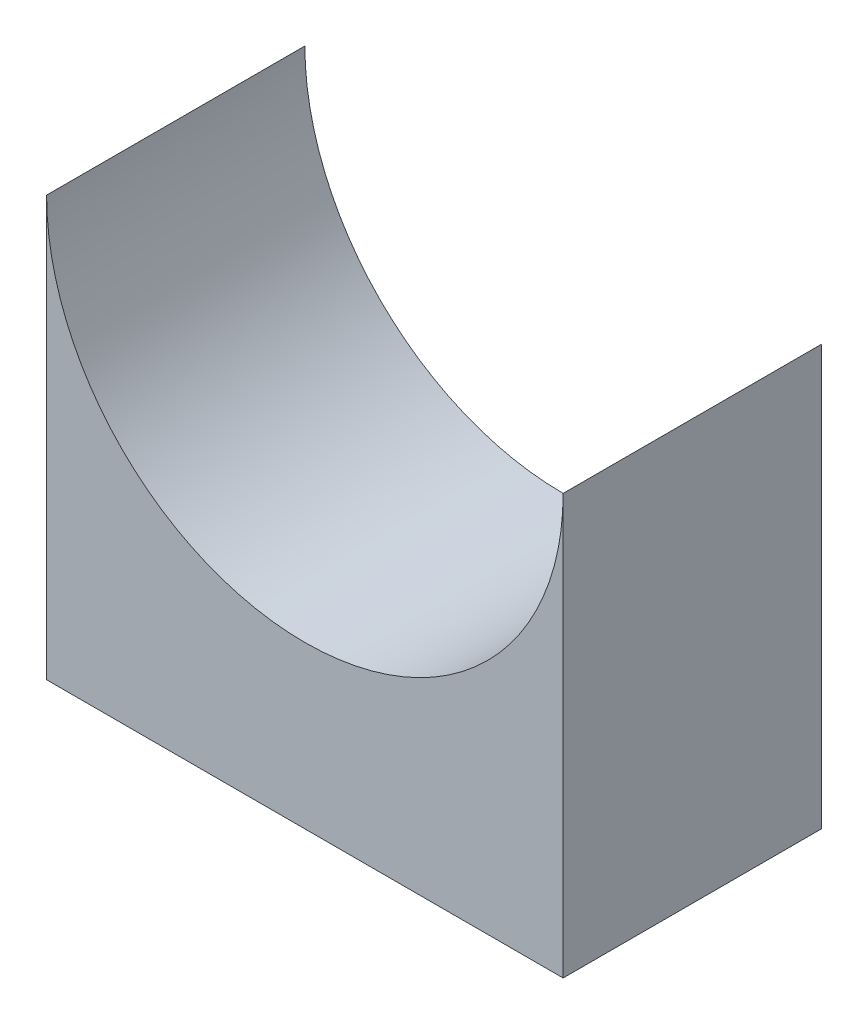
ISO-10303-21;
HEADER;
FILE_DESCRIPTION(('STEP AP214'),'2;1');
FILE_NAME('part.step','',(''),(''),'','','');
FILE_SCHEMA(('AUTOMOTIVE_DESIGN { 1 0 10303 214 1 1 1 1 }'));
ENDSEC;
DATA;
#1=APPLICATION_CONTEXT('core data for automotive mechanical design processes');
#2=APPLICATION_PROTOCOL_DEFINITION('international standard','automotive_design',2000,#1);
#3=PRODUCT_CONTEXT('',#1,'mechanical');
#4=PRODUCT('Part','Part','',(#3));
#5=PRODUCT_RELATED_PRODUCT_CATEGORY('part','',(#4));
#6=PRODUCT_DEFINITION_FORMATION('','',#4);
#7=PRODUCT_DEFINITION_CONTEXT('part definition',#1,'design');
#8=PRODUCT_DEFINITION('design','',#6,#7);
#9=PRODUCT_DEFINITION_SHAPE('','',#8);
#10=(LENGTH_UNIT() NAMED_UNIT(*) SI_UNIT(.MILLI.,.METRE.));
#11=(NAMED_UNIT(*) PLANE_ANGLE_UNIT() SI_UNIT($,.RADIAN.));
#12=(NAMED_UNIT(*) SI_UNIT($,.STERADIAN.) SOLID_ANGLE_UNIT());
#13=UNCERTAINTY_MEASURE_WITH_UNIT(LENGTH_MEASURE(1.E-05),#10,'distance_accuracy_value','');
#14=(GEOMETRIC_REPRESENTATION_CONTEXT(3) GLOBAL_UNCERTAINTY_ASSIGNED_CONTEXT((#13)) GLOBAL_UNIT_ASSIGNED_CONTEXT((#10,
#11,#12)) REPRESENTATION_CONTEXT('',''));
#15=CARTESIAN_POINT('',(0.,0.,0.));
#16=DIRECTION('',(0.,0.,1.));
#17=DIRECTION('',(1.,0.,0.));
#18=AXIS2_PLACEMENT_3D('',#15,#16,#17);
#19=CARTESIAN_POINT('',(0.,0.,20.));
#20=DIRECTION('',(1.,0.,0.));
#21=DIRECTION('',(0.,0.,-1.));
#22=AXIS2_PLACEMENT_3D('',#19,#20,#21);
#23=PLANE('',#22);
#24=DIRECTION('',(0.,-1.,0.));
#25=VECTOR('',#24,1.);
#26=CARTESIAN_POINT('',(0.,0.,0.));
#27=LINE('',#26,#25);
#28=CARTESIAN_POINT('',(0.,32.5000000000003,2.77555756156289E-13));
#29=VERTEX_POINT('',#28);
#30=CARTESIAN_POINT('',(0.,0.,0.));
#31=VERTEX_POINT('',#30);
#32=EDGE_CURVE('E95',#29,#31,#27,.T.);
#33=ORIENTED_EDGE('',*,*,#32,.T.);
#34=DIRECTION('',(0.,0.,-1.));
#35=VECTOR('',#34,1.);
#36=CARTESIAN_POINT('',(0.,0.,20.));
#37=LINE('',#36,#35);
#38=CARTESIAN_POINT('',(0.,0.,20.));
#39=VERTEX_POINT('',#38);
#40=EDGE_CURVE('E11',#39,#31,#37,.T.);
#41=ORIENTED_EDGE('',*,*,#40,.F.);
#42=DIRECTION('',(0.,-1.,0.));
#43=VECTOR('',#42,1.);
#44=CARTESIAN_POINT('',(0.,0.,20.));
#45=LINE('',#44,#43);
#46=CARTESIAN_POINT('',(0.,32.5000000000003,20.0000000000002));
#47=VERTEX_POINT('',#46);
#48=EDGE_CURVE('E83',#47,#39,#45,.T.);
#49=ORIENTED_EDGE('',*,*,#48,.F.);
#50=DIRECTION('',(0.,0.,-1.));
#51=VECTOR('',#50,1.);
#52=CARTESIAN_POINT('',(0.,32.5000000000003,20.0000000000002));
#53=LINE('',#52,#51);
#54=EDGE_CURVE('E91',#47,#29,#53,.T.);
#55=ORIENTED_EDGE('',*,*,#54,.T.);
#56=EDGE_LOOP('',(#33,#41,#49,#55));
#57=FACE_BOUND('',#56,.T.);
#58=ADVANCED_FACE('F32',(#57),#23,.F.);
#59=CARTESIAN_POINT('',(0.,0.,20.));
#60=DIRECTION('',(0.,1.,0.));
#61=DIRECTION('',(0.,0.,1.));
#62=AXIS2_PLACEMENT_3D('',#59,#60,#61);
#63=PLANE('',#62);
#64=DIRECTION('',(1.,0.,0.));
#65=VECTOR('',#64,1.);
#66=CARTESIAN_POINT('',(0.,0.,0.));
#67=LINE('',#66,#65);
#68=CARTESIAN_POINT('',(40.,0.,0.));
#69=VERTEX_POINT('',#68);
#70=EDGE_CURVE('E87',#31,#69,#67,.T.);
#71=ORIENTED_EDGE('',*,*,#70,.T.);
#72=DIRECTION('',(0.,0.,-1.));
#73=VECTOR('',#72,1.);
#74=CARTESIAN_POINT('',(40.,0.,20.));
#75=LINE('',#74,#73);
#76=CARTESIAN_POINT('',(40.,0.,20.));
#77=VERTEX_POINT('',#76);
#78=EDGE_CURVE('E40',#77,#69,#75,.T.);
#79=ORIENTED_EDGE('',*,*,#78,.F.);
#80=DIRECTION('',(1.,0.,0.));
#81=VECTOR('',#80,1.);
#82=CARTESIAN_POINT('',(0.,0.,20.));
#83=LINE('',#82,#81);
#84=EDGE_CURVE('E78',#39,#77,#83,.T.);
#85=ORIENTED_EDGE('',*,*,#84,.F.);
#86=ORIENTED_EDGE('',*,*,#40,.T.);
#87=EDGE_LOOP('',(#71,#79,#85,#86));
#88=FACE_BOUND('',#87,.T.);
#89=ADVANCED_FACE('F86',(#88),#63,.F.);
#90=CARTESIAN_POINT('',(40.,0.,20.));
#91=DIRECTION('',(-1.,0.,0.));
#92=DIRECTION('',(0.,0.,1.));
#93=AXIS2_PLACEMENT_3D('',#90,#91,#92);
#94=PLANE('',#93);
#95=DIRECTION('',(0.,1.,0.));
#96=VECTOR('',#95,1.);
#97=CARTESIAN_POINT('',(40.,0.,0.));
#98=LINE('',#97,#96);
#99=CARTESIAN_POINT('',(40.,32.5000000000003,0.));
#100=VERTEX_POINT('',#99);
#101=EDGE_CURVE('E65',#69,#100,#98,.T.);
#102=ORIENTED_EDGE('',*,*,#101,.T.);
#103=DIRECTION('',(0.,0.,-1.));
#104=VECTOR('',#103,1.);
#105=CARTESIAN_POINT('',(40.,32.5000000000003,20.));
#106=LINE('',#105,#104);
#107=CARTESIAN_POINT('',(40.,32.5000000000003,20.));
#108=VERTEX_POINT('',#107);
#109=EDGE_CURVE('E88',#108,#100,#106,.T.);
#110=ORIENTED_EDGE('',*,*,#109,.F.);
#111=DIRECTION('',(0.,1.,0.));
#112=VECTOR('',#111,1.);
#113=CARTESIAN_POINT('',(40.,0.,20.));
#114=LINE('',#113,#112);
#115=EDGE_CURVE('E81',#77,#108,#114,.T.);
#116=ORIENTED_EDGE('',*,*,#115,.F.);
#117=ORIENTED_EDGE('',*,*,#78,.T.);
#118=EDGE_LOOP('',(#102,#110,#116,#117));
#119=FACE_BOUND('',#118,.T.);
#120=ADVANCED_FACE('F89',(#119),#94,.F.);
#121=CARTESIAN_POINT('',(20.,32.5000000000003,20.0000000000002));
#122=DIRECTION('',(0.,0.,-1.));
#123=DIRECTION('',(-1.,0.,0.));
#124=AXIS2_PLACEMENT_3D('',#121,#122,#123);
#125=CYLINDRICAL_SURFACE('',#124,20.);
#126=CARTESIAN_POINT('',(20.,32.5000000000003,2.77555756156289E-13));
#127=DIRECTION('',(0.,0.,-1.));
#128=DIRECTION('',(-1.,0.,0.));
#129=AXIS2_PLACEMENT_3D('',#126,#127,#128);
#130=CIRCLE('',#129,20.);
#131=EDGE_CURVE('E71',#100,#29,#130,.T.);
#132=ORIENTED_EDGE('',*,*,#131,.T.);
#133=ORIENTED_EDGE('',*,*,#54,.F.);
#134=CARTESIAN_POINT('',(20.,32.5000000000003,20.0000000000002));
#135=DIRECTION('',(0.,0.,-1.));
#136=DIRECTION('',(-1.,0.,0.));
#137=AXIS2_PLACEMENT_3D('',#134,#135,#136);
#138=CIRCLE('',#137,20.);
#139=EDGE_CURVE('E48',#108,#47,#138,.T.);
#140=ORIENTED_EDGE('',*,*,#139,.F.);
#141=ORIENTED_EDGE('',*,*,#109,.T.);
#142=EDGE_LOOP('',(#132,#133,#140,#141));
#143=FACE_BOUND('',#142,.T.);
#144=ADVANCED_FACE('F102',(#143),#125,.F.);
#145=CARTESIAN_POINT('',(20.,32.5000000000003,20.0000000000002));
#146=DIRECTION('',(0.,0.,-1.));
#147=DIRECTION('',(-1.,0.,0.));
#148=AXIS2_PLACEMENT_3D('',#145,#146,#147);
#149=PLANE('',#148);
#150=ORIENTED_EDGE('',*,*,#48,.T.);
#151=ORIENTED_EDGE('',*,*,#84,.T.);
#152=ORIENTED_EDGE('',*,*,#115,.T.);
#153=ORIENTED_EDGE('',*,*,#139,.T.);
#154=EDGE_LOOP('',(#150,#151,#152,#153));
#155=FACE_BOUND('',#154,.T.);
#156=ADVANCED_FACE('F79',(#155),#149,.F.);
#157=CARTESIAN_POINT('',(20.,32.5000000000003,2.77555756156289E-13));
#158=DIRECTION('',(0.,0.,-1.));
#159=DIRECTION('',(-1.,0.,0.));
#160=AXIS2_PLACEMENT_3D('',#157,#158,#159);
#161=PLANE('',#160);
#162=ORIENTED_EDGE('',*,*,#32,.F.);
#163=ORIENTED_EDGE('',*,*,#131,.F.);
#164=ORIENTED_EDGE('',*,*,#101,.F.);
#165=ORIENTED_EDGE('',*,*,#70,.F.);
#166=EDGE_LOOP('',(#162,#163,#164,#165));
#167=FACE_BOUND('',#166,.T.);
#168=ADVANCED_FACE('F105',(#167),#161,.T.);
#169=CLOSED_SHELL('',(#58,#89,#120,#144,#156,#168));
#170=MANIFOLD_SOLID_BREP('B2',#169);
#171=ADVANCED_BREP_SHAPE_REPRESENTATION('',(#18,#170),#14);
#172=SHAPE_DEFINITION_REPRESENTATION(#9,#171);
ENDSEC;
END-ISO-10303-21;
